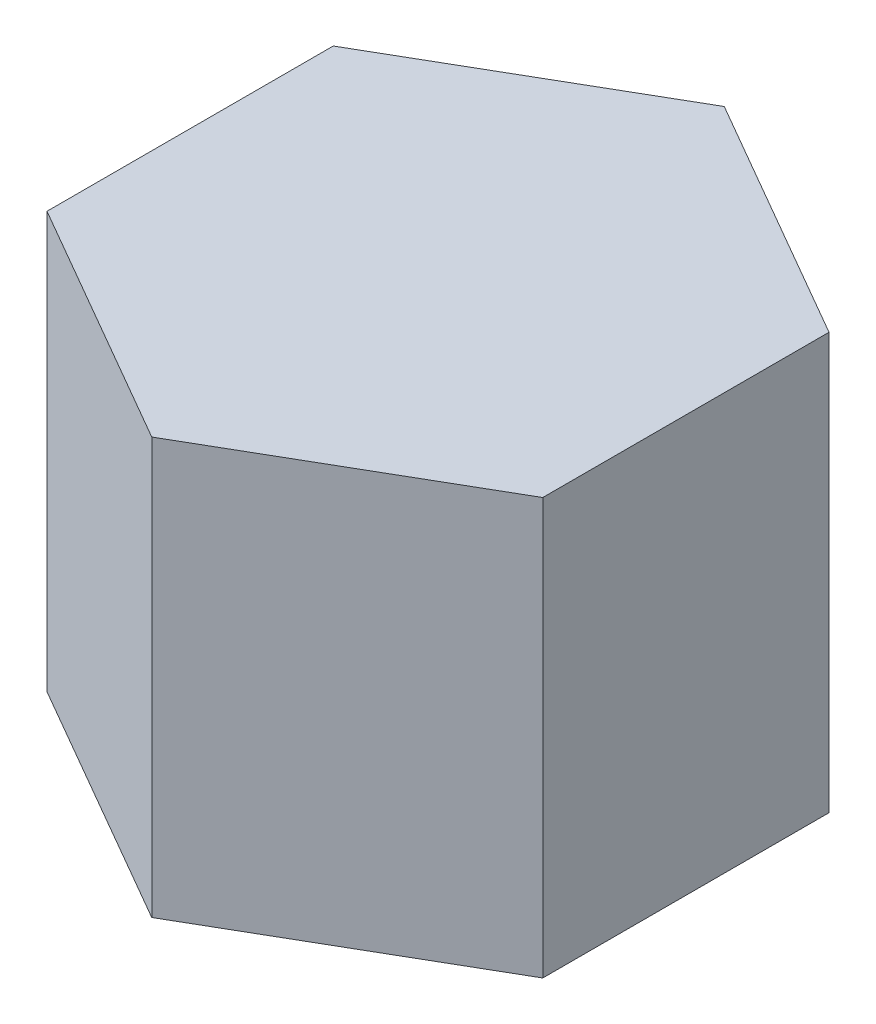
ISO-10303-21;
HEADER;
FILE_DESCRIPTION(('STEP AP214'),'2;1');
FILE_NAME('part.step','',(''),(''),'','','');
FILE_SCHEMA(('AUTOMOTIVE_DESIGN { 1 0 10303 214 1 1 1 1 }'));
ENDSEC;
DATA;
#1=APPLICATION_CONTEXT('core data for automotive mechanical design processes');
#2=APPLICATION_PROTOCOL_DEFINITION('international standard','automotive_design',2000,#1);
#3=PRODUCT_CONTEXT('',#1,'mechanical');
#4=PRODUCT('Part','Part','',(#3));
#5=PRODUCT_RELATED_PRODUCT_CATEGORY('part','',(#4));
#6=PRODUCT_DEFINITION_FORMATION('','',#4);
#7=PRODUCT_DEFINITION_CONTEXT('part definition',#1,'design');
#8=PRODUCT_DEFINITION('design','',#6,#7);
#9=PRODUCT_DEFINITION_SHAPE('','',#8);
#10=(LENGTH_UNIT() NAMED_UNIT(*) SI_UNIT(.MILLI.,.METRE.));
#11=(NAMED_UNIT(*) PLANE_ANGLE_UNIT() SI_UNIT($,.RADIAN.));
#12=(NAMED_UNIT(*) SI_UNIT($,.STERADIAN.) SOLID_ANGLE_UNIT());
#13=UNCERTAINTY_MEASURE_WITH_UNIT(LENGTH_MEASURE(1.E-05),#10,'distance_accuracy_value','');
#14=(GEOMETRIC_REPRESENTATION_CONTEXT(3) GLOBAL_UNCERTAINTY_ASSIGNED_CONTEXT((#13)) GLOBAL_UNIT_ASSIGNED_CONTEXT((#10,
#11,#12)) REPRESENTATION_CONTEXT('',''));
#15=CARTESIAN_POINT('',(0.,0.,0.));
#16=DIRECTION('',(0.,0.,1.));
#17=DIRECTION('',(1.,0.,0.));
#18=AXIS2_PLACEMENT_3D('',#15,#16,#17);
#19=CARTESIAN_POINT('',(209.339551417382,-147.556598747966,288.217869605357));
#20=DIRECTION('',(-0.499999999999978,0.,-0.866025403784452));
#21=DIRECTION('',(-0.866025403784452,0.,0.499999999999978));
#22=AXIS2_PLACEMENT_3D('',#19,#20,#21);
#23=PLANE('',#22);
#24=CARTESIAN_POINT('',(209.642660308706,-147.047793579175,288.042869605357));
#25=DIRECTION('',(-0.866025403784452,0.,0.499999999999978));
#26=VECTOR('',#25,1.);
#27=LINE('',#24,#26);
#28=CARTESIAN_POINT('',(209.642660308706,-147.047793579175,288.042869605357));
#29=VERTEX_POINT('',#28);
#30=CARTESIAN_POINT('',(209.339551417382,-147.047793579175,288.217869605357));
#31=VERTEX_POINT('',#30);
#32=EDGE_CURVE('E170',#29,#31,#27,.T.);
#33=ORIENTED_EDGE('',*,*,#32,.T.);
#34=CARTESIAN_POINT('',(209.339551417382,-147.556598747966,288.217869605357));
#35=DIRECTION('',(0.,1.,0.));
#36=VECTOR('',#35,1.);
#37=LINE('',#34,#36);
#38=CARTESIAN_POINT('',(209.339551417382,-147.556598747966,288.217869605357));
#39=VERTEX_POINT('',#38);
#40=EDGE_CURVE('E35',#39,#31,#37,.T.);
#41=ORIENTED_EDGE('',*,*,#40,.F.);
#42=CARTESIAN_POINT('',(209.642660308706,-147.556598747966,288.042869605357));
#43=DIRECTION('',(-0.866025403784452,0.,0.499999999999978));
#44=VECTOR('',#43,1.);
#45=LINE('',#42,#44);
#46=CARTESIAN_POINT('',(209.642660308706,-147.556598747966,288.042869605357));
#47=VERTEX_POINT('',#46);
#48=EDGE_CURVE('E159',#47,#39,#45,.T.);
#49=ORIENTED_EDGE('',*,*,#48,.F.);
#50=CARTESIAN_POINT('',(209.642660308706,-147.556598747966,288.042869605357));
#51=DIRECTION('',(0.,1.,0.));
#52=VECTOR('',#51,1.);
#53=LINE('',#50,#52);
#54=EDGE_CURVE('E10',#47,#29,#53,.T.);
#55=ORIENTED_EDGE('',*,*,#54,.T.);
#56=EDGE_LOOP('',(#33,#41,#49,#55));
#57=FACE_BOUND('',#56,.T.);
#58=ADVANCED_FACE('F16',(#57),#23,.F.);
#59=CARTESIAN_POINT('',(209.642660308706,-147.556598747966,291.594471220494));
#60=DIRECTION('',(-1.,0.,0.));
#61=DIRECTION('',(0.,-1.,0.));
#62=AXIS2_PLACEMENT_3D('',#59,#60,#61);
#63=PLANE('',#62);
#64=CARTESIAN_POINT('',(209.642660308706,-147.047793579175,287.692869605357));
#65=DIRECTION('',(0.,0.,1.));
#66=VECTOR('',#65,1.);
#67=LINE('',#64,#66);
#68=CARTESIAN_POINT('',(209.642660308706,-147.047793579175,287.692869605357));
#69=VERTEX_POINT('',#68);
#70=EDGE_CURVE('E167',#69,#29,#67,.T.);
#71=ORIENTED_EDGE('',*,*,#70,.T.);
#72=ORIENTED_EDGE('',*,*,#54,.F.);
#73=CARTESIAN_POINT('',(209.642660308706,-147.556598747966,287.692869605357));
#74=DIRECTION('',(0.,0.,1.));
#75=VECTOR('',#74,1.);
#76=LINE('',#73,#75);
#77=CARTESIAN_POINT('',(209.642660308706,-147.556598747966,287.692869605357));
#78=VERTEX_POINT('',#77);
#79=EDGE_CURVE('E156',#78,#47,#76,.T.);
#80=ORIENTED_EDGE('',*,*,#79,.F.);
#81=CARTESIAN_POINT('',(209.642660308706,-147.556598747966,287.692869605357));
#82=DIRECTION('',(0.,1.,0.));
#83=VECTOR('',#82,1.);
#84=LINE('',#81,#83);
#85=EDGE_CURVE('E27',#78,#69,#84,.T.);
#86=ORIENTED_EDGE('',*,*,#85,.T.);
#87=EDGE_LOOP('',(#71,#72,#80,#86));
#88=FACE_BOUND('',#87,.T.);
#89=ADVANCED_FACE('F189',(#88),#63,.F.);
#90=CARTESIAN_POINT('',(209.642660308706,-147.556598747966,287.692869605357));
#91=DIRECTION('',(-0.499999999999943,0.,0.866025403784471));
#92=DIRECTION('',(0.866025403784471,0.,0.499999999999943));
#93=AXIS2_PLACEMENT_3D('',#90,#91,#92);
#94=PLANE('',#93);
#95=CARTESIAN_POINT('',(209.339551417382,-147.047793579175,287.517869605357));
#96=DIRECTION('',(0.866025403784471,0.,0.499999999999943));
#97=VECTOR('',#96,1.);
#98=LINE('',#95,#97);
#99=CARTESIAN_POINT('',(209.339551417382,-147.047793579175,287.517869605357));
#100=VERTEX_POINT('',#99);
#101=EDGE_CURVE('E163',#100,#69,#98,.T.);
#102=ORIENTED_EDGE('',*,*,#101,.T.);
#103=ORIENTED_EDGE('',*,*,#85,.F.);
#104=CARTESIAN_POINT('',(209.339551417382,-147.556598747966,287.517869605357));
#105=DIRECTION('',(0.866025403784471,0.,0.499999999999943));
#106=VECTOR('',#105,1.);
#107=LINE('',#104,#106);
#108=CARTESIAN_POINT('',(209.339551417382,-147.556598747966,287.517869605357));
#109=VERTEX_POINT('',#108);
#110=EDGE_CURVE('E106',#109,#78,#107,.T.);
#111=ORIENTED_EDGE('',*,*,#110,.F.);
#112=CARTESIAN_POINT('',(209.339551417382,-147.556598747966,287.517869605357));
#113=DIRECTION('',(0.,1.,0.));
#114=VECTOR('',#113,1.);
#115=LINE('',#112,#114);
#116=EDGE_CURVE('E94',#109,#100,#115,.T.);
#117=ORIENTED_EDGE('',*,*,#116,.T.);
#118=EDGE_LOOP('',(#102,#103,#111,#117));
#119=FACE_BOUND('',#118,.T.);
#120=ADVANCED_FACE('F198',(#119),#94,.F.);
#121=CARTESIAN_POINT('',(209.339551417382,-147.556598747966,287.517869605357));
#122=DIRECTION('',(0.499999999999978,0.,0.866025403784452));
#123=DIRECTION('',(0.866025403784452,0.,-0.499999999999978));
#124=AXIS2_PLACEMENT_3D('',#121,#122,#123);
#125=PLANE('',#124);
#126=CARTESIAN_POINT('',(209.036442526057,-147.047793579175,287.692869605357));
#127=DIRECTION('',(0.866025403784452,0.,-0.499999999999978));
#128=VECTOR('',#127,1.);
#129=LINE('',#126,#128);
#130=CARTESIAN_POINT('',(209.036442526057,-147.047793579175,287.692869605357));
#131=VERTEX_POINT('',#130);
#132=EDGE_CURVE('E162',#131,#100,#129,.T.);
#133=ORIENTED_EDGE('',*,*,#132,.T.);
#134=ORIENTED_EDGE('',*,*,#116,.F.);
#135=CARTESIAN_POINT('',(209.036442526057,-147.556598747966,287.692869605357));
#136=DIRECTION('',(0.866025403784452,0.,-0.499999999999978));
#137=VECTOR('',#136,1.);
#138=LINE('',#135,#137);
#139=CARTESIAN_POINT('',(209.036442526057,-147.556598747966,287.692869605357));
#140=VERTEX_POINT('',#139);
#141=EDGE_CURVE('E98',#140,#109,#138,.T.);
#142=ORIENTED_EDGE('',*,*,#141,.F.);
#143=CARTESIAN_POINT('',(209.036442526057,-147.556598747966,287.692869605357));
#144=DIRECTION('',(0.,1.,0.));
#145=VECTOR('',#144,1.);
#146=LINE('',#143,#145);
#147=EDGE_CURVE('E79',#140,#131,#146,.T.);
#148=ORIENTED_EDGE('',*,*,#147,.T.);
#149=EDGE_LOOP('',(#133,#134,#142,#148));
#150=FACE_BOUND('',#149,.T.);
#151=ADVANCED_FACE('F100',(#150),#125,.F.);
#152=CARTESIAN_POINT('',(209.036442526057,-147.556598747966,291.594471220494));
#153=DIRECTION('',(1.,0.,0.));
#154=DIRECTION('',(0.,1.,0.));
#155=AXIS2_PLACEMENT_3D('',#152,#153,#154);
#156=PLANE('',#155);
#157=CARTESIAN_POINT('',(209.036442526057,-147.047793579175,288.042869605357));
#158=DIRECTION('',(0.,0.,-1.));
#159=VECTOR('',#158,1.);
#160=LINE('',#157,#159);
#161=CARTESIAN_POINT('',(209.036442526057,-147.047793579175,288.042869605357));
#162=VERTEX_POINT('',#161);
#163=EDGE_CURVE('E88',#162,#131,#160,.T.);
#164=ORIENTED_EDGE('',*,*,#163,.T.);
#165=ORIENTED_EDGE('',*,*,#147,.F.);
#166=CARTESIAN_POINT('',(209.036442526057,-147.556598747966,288.042869605357));
#167=DIRECTION('',(0.,0.,-1.));
#168=VECTOR('',#167,1.);
#169=LINE('',#166,#168);
#170=CARTESIAN_POINT('',(209.036442526057,-147.556598747966,288.042869605357));
#171=VERTEX_POINT('',#170);
#172=EDGE_CURVE('E84',#171,#140,#169,.T.);
#173=ORIENTED_EDGE('',*,*,#172,.F.);
#174=CARTESIAN_POINT('',(209.036442526057,-147.556598747966,288.042869605357));
#175=DIRECTION('',(0.,1.,0.));
#176=VECTOR('',#175,1.);
#177=LINE('',#174,#176);
#178=EDGE_CURVE('E58',#171,#162,#177,.T.);
#179=ORIENTED_EDGE('',*,*,#178,.T.);
#180=EDGE_LOOP('',(#164,#165,#173,#179));
#181=FACE_BOUND('',#180,.T.);
#182=ADVANCED_FACE('F82',(#181),#156,.F.);
#183=CARTESIAN_POINT('',(209.036442526057,-147.556598747966,288.042869605357));
#184=DIRECTION('',(0.499999999999943,0.,-0.866025403784471));
#185=DIRECTION('',(-0.866025403784471,0.,-0.499999999999943));
#186=AXIS2_PLACEMENT_3D('',#183,#184,#185);
#187=PLANE('',#186);
#188=CARTESIAN_POINT('',(209.339551417382,-147.047793579175,288.217869605357));
#189=DIRECTION('',(-0.866025403784471,0.,-0.499999999999943));
#190=VECTOR('',#189,1.);
#191=LINE('',#188,#190);
#192=EDGE_CURVE('E160',#31,#162,#191,.T.);
#193=ORIENTED_EDGE('',*,*,#192,.T.);
#194=ORIENTED_EDGE('',*,*,#178,.F.);
#195=CARTESIAN_POINT('',(209.339551417382,-147.556598747966,288.217869605357));
#196=DIRECTION('',(-0.866025403784471,0.,-0.499999999999943));
#197=VECTOR('',#196,1.);
#198=LINE('',#195,#197);
#199=EDGE_CURVE('E112',#39,#171,#198,.T.);
#200=ORIENTED_EDGE('',*,*,#199,.F.);
#201=ORIENTED_EDGE('',*,*,#40,.T.);
#202=EDGE_LOOP('',(#193,#194,#200,#201));
#203=FACE_BOUND('',#202,.T.);
#204=ADVANCED_FACE('F131',(#203),#187,.F.);
#205=CARTESIAN_POINT('',(206.491105863044,-147.556598747966,291.594471220494));
#206=DIRECTION('',(0.,1.,0.));
#207=DIRECTION('',(-1.,0.,0.));
#208=AXIS2_PLACEMENT_3D('',#205,#206,#207);
#209=PLANE('',#208);
#210=ORIENTED_EDGE('',*,*,#48,.T.);
#211=ORIENTED_EDGE('',*,*,#199,.T.);
#212=ORIENTED_EDGE('',*,*,#172,.T.);
#213=ORIENTED_EDGE('',*,*,#141,.T.);
#214=ORIENTED_EDGE('',*,*,#110,.T.);
#215=ORIENTED_EDGE('',*,*,#79,.T.);
#216=EDGE_LOOP('',(#210,#211,#212,#213,#214,#215));
#217=FACE_BOUND('',#216,.T.);
#218=ADVANCED_FACE('F111',(#217),#209,.F.);
#219=CARTESIAN_POINT('',(206.491105863044,-147.047793579175,291.594471220494));
#220=DIRECTION('',(0.,1.,0.));
#221=DIRECTION('',(-1.,0.,0.));
#222=AXIS2_PLACEMENT_3D('',#219,#220,#221);
#223=PLANE('',#222);
#224=ORIENTED_EDGE('',*,*,#32,.F.);
#225=ORIENTED_EDGE('',*,*,#70,.F.);
#226=ORIENTED_EDGE('',*,*,#101,.F.);
#227=ORIENTED_EDGE('',*,*,#132,.F.);
#228=ORIENTED_EDGE('',*,*,#163,.F.);
#229=ORIENTED_EDGE('',*,*,#192,.F.);
#230=EDGE_LOOP('',(#224,#225,#226,#227,#228,#229));
#231=FACE_BOUND('',#230,.T.);
#232=ADVANCED_FACE('F130',(#231),#223,.T.);
#233=CLOSED_SHELL('',(#58,#89,#120,#151,#182,#204,#218,#232));
#234=MANIFOLD_SOLID_BREP('B1',#233);
#235=ADVANCED_BREP_SHAPE_REPRESENTATION('',(#18,#234),#14);
#236=SHAPE_DEFINITION_REPRESENTATION(#9,#235);
ENDSEC;
END-ISO-10303-21;
